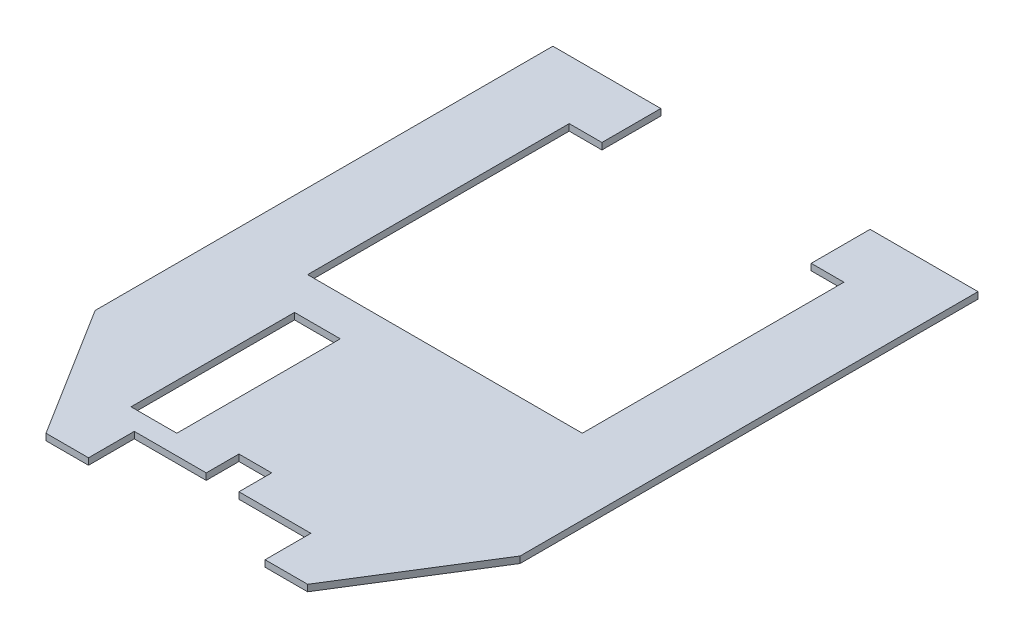
ISO-10303-21;
HEADER;
FILE_DESCRIPTION(('STEP AP214'),'2;1');
FILE_NAME('part.step','',(''),(''),'','','');
FILE_SCHEMA(('AUTOMOTIVE_DESIGN { 1 0 10303 214 1 1 1 1 }'));
ENDSEC;
DATA;
#1=APPLICATION_CONTEXT('core data for automotive mechanical design processes');
#2=APPLICATION_PROTOCOL_DEFINITION('international standard','automotive_design',2000,#1);
#3=PRODUCT_CONTEXT('',#1,'mechanical');
#4=PRODUCT('Part','Part','',(#3));
#5=PRODUCT_RELATED_PRODUCT_CATEGORY('part','',(#4));
#6=PRODUCT_DEFINITION_FORMATION('','',#4);
#7=PRODUCT_DEFINITION_CONTEXT('part definition',#1,'design');
#8=PRODUCT_DEFINITION('design','',#6,#7);
#9=PRODUCT_DEFINITION_SHAPE('','',#8);
#10=(LENGTH_UNIT() NAMED_UNIT(*) SI_UNIT(.MILLI.,.METRE.));
#11=(NAMED_UNIT(*) PLANE_ANGLE_UNIT() SI_UNIT($,.RADIAN.));
#12=(NAMED_UNIT(*) SI_UNIT($,.STERADIAN.) SOLID_ANGLE_UNIT());
#13=UNCERTAINTY_MEASURE_WITH_UNIT(LENGTH_MEASURE(1.E-05),#10,'distance_accuracy_value','');
#14=(GEOMETRIC_REPRESENTATION_CONTEXT(3) GLOBAL_UNCERTAINTY_ASSIGNED_CONTEXT((#13)) GLOBAL_UNIT_ASSIGNED_CONTEXT((#10,
#11,#12)) REPRESENTATION_CONTEXT('',''));
#15=CARTESIAN_POINT('',(0.,0.,0.));
#16=DIRECTION('',(0.,0.,1.));
#17=DIRECTION('',(1.,0.,0.));
#18=AXIS2_PLACEMENT_3D('',#15,#16,#17);
#19=CARTESIAN_POINT('',(0.,1.,52.));
#20=DIRECTION('',(0.,1.,0.));
#21=DIRECTION('',(0.,0.,1.));
#22=AXIS2_PLACEMENT_3D('',#19,#20,#21);
#23=PLANE('',#22);
#24=DIRECTION('',(0.52999894000318,0.,0.847998304005088));
#25=VECTOR('',#24,1.);
#26=CARTESIAN_POINT('',(-32.5,1.,0.));
#27=LINE('',#26,#25);
#28=CARTESIAN_POINT('',(-32.5,1.,0.));
#29=VERTEX_POINT('',#28);
#30=CARTESIAN_POINT('',(-20.,1.,20.));
#31=VERTEX_POINT('',#30);
#32=EDGE_CURVE('E240',#29,#31,#27,.T.);
#33=ORIENTED_EDGE('',*,*,#32,.T.);
#34=DIRECTION('',(1.,0.,0.));
#35=VECTOR('',#34,1.);
#36=CARTESIAN_POINT('',(-20.,1.,20.));
#37=LINE('',#36,#35);
#38=CARTESIAN_POINT('',(-13.5,1.,20.));
#39=VERTEX_POINT('',#38);
#40=EDGE_CURVE('E243',#31,#39,#37,.T.);
#41=ORIENTED_EDGE('',*,*,#40,.T.);
#42=DIRECTION('',(0.,0.,-1.));
#43=VECTOR('',#42,1.);
#44=CARTESIAN_POINT('',(-13.5,1.,20.));
#45=LINE('',#44,#43);
#46=CARTESIAN_POINT('',(-13.5,1.,13.));
#47=VERTEX_POINT('',#46);
#48=EDGE_CURVE('E246',#39,#47,#45,.T.);
#49=ORIENTED_EDGE('',*,*,#48,.T.);
#50=DIRECTION('',(1.,0.,0.));
#51=VECTOR('',#50,1.);
#52=CARTESIAN_POINT('',(-13.5,1.,13.));
#53=LINE('',#52,#51);
#54=CARTESIAN_POINT('',(-2.5,1.,13.));
#55=VERTEX_POINT('',#54);
#56=EDGE_CURVE('E248',#47,#55,#53,.T.);
#57=ORIENTED_EDGE('',*,*,#56,.T.);
#58=DIRECTION('',(0.,0.,-1.));
#59=VECTOR('',#58,1.);
#60=CARTESIAN_POINT('',(-2.5,1.,13.));
#61=LINE('',#60,#59);
#62=CARTESIAN_POINT('',(-2.5,1.,8.));
#63=VERTEX_POINT('',#62);
#64=EDGE_CURVE('E250',#55,#63,#61,.T.);
#65=ORIENTED_EDGE('',*,*,#64,.T.);
#66=DIRECTION('',(1.,0.,0.));
#67=VECTOR('',#66,1.);
#68=CARTESIAN_POINT('',(-2.5,1.,8.));
#69=LINE('',#68,#67);
#70=CARTESIAN_POINT('',(2.5,1.,8.));
#71=VERTEX_POINT('',#70);
#72=EDGE_CURVE('E252',#63,#71,#69,.T.);
#73=ORIENTED_EDGE('',*,*,#72,.T.);
#74=DIRECTION('',(0.,0.,1.));
#75=VECTOR('',#74,1.);
#76=CARTESIAN_POINT('',(2.5,1.,8.));
#77=LINE('',#76,#75);
#78=CARTESIAN_POINT('',(2.5,1.,13.));
#79=VERTEX_POINT('',#78);
#80=EDGE_CURVE('E254',#71,#79,#77,.T.);
#81=ORIENTED_EDGE('',*,*,#80,.T.);
#82=DIRECTION('',(1.,0.,0.));
#83=VECTOR('',#82,1.);
#84=CARTESIAN_POINT('',(2.5,1.,13.));
#85=LINE('',#84,#83);
#86=CARTESIAN_POINT('',(13.5,1.,13.));
#87=VERTEX_POINT('',#86);
#88=EDGE_CURVE('E256',#79,#87,#85,.T.);
#89=ORIENTED_EDGE('',*,*,#88,.T.);
#90=DIRECTION('',(0.,0.,1.));
#91=VECTOR('',#90,1.);
#92=CARTESIAN_POINT('',(13.5,1.,13.));
#93=LINE('',#92,#91);
#94=CARTESIAN_POINT('',(13.5,1.,20.));
#95=VERTEX_POINT('',#94);
#96=EDGE_CURVE('E258',#87,#95,#93,.T.);
#97=ORIENTED_EDGE('',*,*,#96,.T.);
#98=DIRECTION('',(1.,0.,0.));
#99=VECTOR('',#98,1.);
#100=CARTESIAN_POINT('',(13.5,1.,20.));
#101=LINE('',#100,#99);
#102=CARTESIAN_POINT('',(20.,1.,20.));
#103=VERTEX_POINT('',#102);
#104=EDGE_CURVE('E260',#95,#103,#101,.T.);
#105=ORIENTED_EDGE('',*,*,#104,.T.);
#106=DIRECTION('',(0.52999894000318,0.,-0.847998304005088));
#107=VECTOR('',#106,1.);
#108=CARTESIAN_POINT('',(20.,1.,20.));
#109=LINE('',#108,#107);
#110=CARTESIAN_POINT('',(32.5,1.,0.));
#111=VERTEX_POINT('',#110);
#112=EDGE_CURVE('E262',#103,#111,#109,.T.);
#113=ORIENTED_EDGE('',*,*,#112,.T.);
#114=DIRECTION('',(0.,0.,-1.));
#115=VECTOR('',#114,1.);
#116=CARTESIAN_POINT('',(32.5,1.,0.));
#117=LINE('',#116,#115);
#118=CARTESIAN_POINT('',(32.5,1.,-70.));
#119=VERTEX_POINT('',#118);
#120=EDGE_CURVE('E264',#111,#119,#117,.T.);
#121=ORIENTED_EDGE('',*,*,#120,.T.);
#122=DIRECTION('',(-1.,0.,0.));
#123=VECTOR('',#122,1.);
#124=CARTESIAN_POINT('',(32.5,1.,-70.));
#125=LINE('',#124,#123);
#126=CARTESIAN_POINT('',(16.,1.,-70.));
#127=VERTEX_POINT('',#126);
#128=EDGE_CURVE('E266',#119,#127,#125,.T.);
#129=ORIENTED_EDGE('',*,*,#128,.T.);
#130=DIRECTION('',(0.,0.,1.));
#131=VECTOR('',#130,1.);
#132=CARTESIAN_POINT('',(16.,1.,-61.));
#133=LINE('',#132,#131);
#134=CARTESIAN_POINT('',(16.,1.,-61.));
#135=VERTEX_POINT('',#134);
#136=EDGE_CURVE('E268',#127,#135,#133,.T.);
#137=ORIENTED_EDGE('',*,*,#136,.T.);
#138=DIRECTION('',(1.,0.,0.));
#139=VECTOR('',#138,1.);
#140=CARTESIAN_POINT('',(21.,1.,-61.));
#141=LINE('',#140,#139);
#142=CARTESIAN_POINT('',(21.,1.,-61.));
#143=VERTEX_POINT('',#142);
#144=EDGE_CURVE('E270',#135,#143,#141,.T.);
#145=ORIENTED_EDGE('',*,*,#144,.T.);
#146=DIRECTION('',(0.,0.,1.));
#147=VECTOR('',#146,1.);
#148=CARTESIAN_POINT('',(21.,1.,-61.));
#149=LINE('',#148,#147);
#150=CARTESIAN_POINT('',(21.,1.,-21.));
#151=VERTEX_POINT('',#150);
#152=EDGE_CURVE('E272',#143,#151,#149,.T.);
#153=ORIENTED_EDGE('',*,*,#152,.T.);
#154=DIRECTION('',(-1.,0.,0.));
#155=VECTOR('',#154,1.);
#156=CARTESIAN_POINT('',(21.,1.,-21.));
#157=LINE('',#156,#155);
#158=CARTESIAN_POINT('',(-21.,1.,-21.));
#159=VERTEX_POINT('',#158);
#160=EDGE_CURVE('E274',#151,#159,#157,.T.);
#161=ORIENTED_EDGE('',*,*,#160,.T.);
#162=DIRECTION('',(0.,0.,-1.));
#163=VECTOR('',#162,1.);
#164=CARTESIAN_POINT('',(-21.,1.,-61.));
#165=LINE('',#164,#163);
#166=CARTESIAN_POINT('',(-21.,1.,-61.));
#167=VERTEX_POINT('',#166);
#168=EDGE_CURVE('E276',#159,#167,#165,.T.);
#169=ORIENTED_EDGE('',*,*,#168,.T.);
#170=DIRECTION('',(1.,0.,0.));
#171=VECTOR('',#170,1.);
#172=CARTESIAN_POINT('',(-16.,1.,-61.));
#173=LINE('',#172,#171);
#174=CARTESIAN_POINT('',(-16.,1.,-61.));
#175=VERTEX_POINT('',#174);
#176=EDGE_CURVE('E278',#167,#175,#173,.T.);
#177=ORIENTED_EDGE('',*,*,#176,.T.);
#178=DIRECTION('',(0.,0.,-1.));
#179=VECTOR('',#178,1.);
#180=CARTESIAN_POINT('',(-16.,1.,-61.));
#181=LINE('',#180,#179);
#182=CARTESIAN_POINT('',(-16.,1.,-70.));
#183=VERTEX_POINT('',#182);
#184=EDGE_CURVE('E280',#175,#183,#181,.T.);
#185=ORIENTED_EDGE('',*,*,#184,.T.);
#186=DIRECTION('',(-1.,0.,0.));
#187=VECTOR('',#186,1.);
#188=CARTESIAN_POINT('',(-16.,1.,-70.));
#189=LINE('',#188,#187);
#190=CARTESIAN_POINT('',(-32.5,1.,-70.));
#191=VERTEX_POINT('',#190);
#192=EDGE_CURVE('E282',#183,#191,#189,.T.);
#193=ORIENTED_EDGE('',*,*,#192,.T.);
#194=DIRECTION('',(0.,0.,1.));
#195=VECTOR('',#194,1.);
#196=CARTESIAN_POINT('',(-32.5,1.,-70.));
#197=LINE('',#196,#195);
#198=EDGE_CURVE('E284',#191,#29,#197,.T.);
#199=ORIENTED_EDGE('',*,*,#198,.T.);
#200=EDGE_LOOP('',(#33,#41,#49,#57,#65,#73,#81,#89,#97,#105,#113,#121,#129,#137,#145,#153,#161,
#169,#177,#185,#193,#199));
#201=FACE_BOUND('',#200,.T.);
#202=DIRECTION('',(-1.,0.,0.));
#203=VECTOR('',#202,1.);
#204=CARTESIAN_POINT('',(-10.,1.,-15.));
#205=LINE('',#204,#203);
#206=CARTESIAN_POINT('',(-10.,1.,-15.));
#207=VERTEX_POINT('',#206);
#208=CARTESIAN_POINT('',(-17.,1.,-15.));
#209=VERTEX_POINT('',#208);
#210=EDGE_CURVE('E212',#207,#209,#205,.T.);
#211=ORIENTED_EDGE('',*,*,#210,.F.);
#212=DIRECTION('',(0.,0.,-1.));
#213=VECTOR('',#212,1.);
#214=CARTESIAN_POINT('',(-10.,1.,10.));
#215=LINE('',#214,#213);
#216=CARTESIAN_POINT('',(-10.,1.,10.));
#217=VERTEX_POINT('',#216);
#218=EDGE_CURVE('E204',#217,#207,#215,.T.);
#219=ORIENTED_EDGE('',*,*,#218,.F.);
#220=DIRECTION('',(1.,0.,0.));
#221=VECTOR('',#220,1.);
#222=CARTESIAN_POINT('',(-10.,1.,10.));
#223=LINE('',#222,#221);
#224=CARTESIAN_POINT('',(-17.,1.,10.));
#225=VERTEX_POINT('',#224);
#226=EDGE_CURVE('E226',#225,#217,#223,.T.);
#227=ORIENTED_EDGE('',*,*,#226,.F.);
#228=DIRECTION('',(0.,0.,1.));
#229=VECTOR('',#228,1.);
#230=CARTESIAN_POINT('',(-17.,1.,10.));
#231=LINE('',#230,#229);
#232=EDGE_CURVE('E224',#209,#225,#231,.T.);
#233=ORIENTED_EDGE('',*,*,#232,.F.);
#234=EDGE_LOOP('',(#211,#219,#227,#233));
#235=FACE_BOUND('',#234,.T.);
#236=ADVANCED_FACE('F31',(#201,#235),#23,.T.);
#237=CARTESIAN_POINT('',(0.,0.,52.));
#238=DIRECTION('',(0.,1.,0.));
#239=DIRECTION('',(0.,0.,1.));
#240=AXIS2_PLACEMENT_3D('',#237,#238,#239);
#241=PLANE('',#240);
#242=DIRECTION('',(0.52999894000318,0.,0.847998304005088));
#243=VECTOR('',#242,1.);
#244=CARTESIAN_POINT('',(-32.5,0.,0.));
#245=LINE('',#244,#243);
#246=CARTESIAN_POINT('',(-32.5,0.,0.));
#247=VERTEX_POINT('',#246);
#248=CARTESIAN_POINT('',(-20.,0.,20.));
#249=VERTEX_POINT('',#248);
#250=EDGE_CURVE('E220',#247,#249,#245,.T.);
#251=ORIENTED_EDGE('',*,*,#250,.F.);
#252=DIRECTION('',(0.,0.,1.));
#253=VECTOR('',#252,1.);
#254=CARTESIAN_POINT('',(-32.5,0.,-70.));
#255=LINE('',#254,#253);
#256=CARTESIAN_POINT('',(-32.5,0.,-70.));
#257=VERTEX_POINT('',#256);
#258=EDGE_CURVE('E244',#257,#247,#255,.T.);
#259=ORIENTED_EDGE('',*,*,#258,.F.);
#260=DIRECTION('',(-1.,0.,0.));
#261=VECTOR('',#260,1.);
#262=CARTESIAN_POINT('',(-16.,0.,-70.));
#263=LINE('',#262,#261);
#264=CARTESIAN_POINT('',(-16.,0.,-70.));
#265=VERTEX_POINT('',#264);
#266=EDGE_CURVE('E327',#265,#257,#263,.T.);
#267=ORIENTED_EDGE('',*,*,#266,.F.);
#268=DIRECTION('',(0.,0.,-1.));
#269=VECTOR('',#268,1.);
#270=CARTESIAN_POINT('',(-16.,0.,-61.));
#271=LINE('',#270,#269);
#272=CARTESIAN_POINT('',(-16.,0.,-61.));
#273=VERTEX_POINT('',#272);
#274=EDGE_CURVE('E325',#273,#265,#271,.T.);
#275=ORIENTED_EDGE('',*,*,#274,.F.);
#276=DIRECTION('',(1.,0.,0.));
#277=VECTOR('',#276,1.);
#278=CARTESIAN_POINT('',(-16.,0.,-61.));
#279=LINE('',#278,#277);
#280=CARTESIAN_POINT('',(-21.,0.,-61.));
#281=VERTEX_POINT('',#280);
#282=EDGE_CURVE('E323',#281,#273,#279,.T.);
#283=ORIENTED_EDGE('',*,*,#282,.F.);
#284=DIRECTION('',(0.,0.,-1.));
#285=VECTOR('',#284,1.);
#286=CARTESIAN_POINT('',(-21.,0.,-61.));
#287=LINE('',#286,#285);
#288=CARTESIAN_POINT('',(-21.,0.,-21.));
#289=VERTEX_POINT('',#288);
#290=EDGE_CURVE('E321',#289,#281,#287,.T.);
#291=ORIENTED_EDGE('',*,*,#290,.F.);
#292=DIRECTION('',(-1.,0.,0.));
#293=VECTOR('',#292,1.);
#294=CARTESIAN_POINT('',(21.,0.,-21.));
#295=LINE('',#294,#293);
#296=CARTESIAN_POINT('',(21.,0.,-21.));
#297=VERTEX_POINT('',#296);
#298=EDGE_CURVE('E319',#297,#289,#295,.T.);
#299=ORIENTED_EDGE('',*,*,#298,.F.);
#300=DIRECTION('',(0.,0.,1.));
#301=VECTOR('',#300,1.);
#302=CARTESIAN_POINT('',(21.,0.,-61.));
#303=LINE('',#302,#301);
#304=CARTESIAN_POINT('',(21.,0.,-61.));
#305=VERTEX_POINT('',#304);
#306=EDGE_CURVE('E317',#305,#297,#303,.T.);
#307=ORIENTED_EDGE('',*,*,#306,.F.);
#308=DIRECTION('',(1.,0.,0.));
#309=VECTOR('',#308,1.);
#310=CARTESIAN_POINT('',(21.,0.,-61.));
#311=LINE('',#310,#309);
#312=CARTESIAN_POINT('',(16.,0.,-61.));
#313=VERTEX_POINT('',#312);
#314=EDGE_CURVE('E315',#313,#305,#311,.T.);
#315=ORIENTED_EDGE('',*,*,#314,.F.);
#316=DIRECTION('',(0.,0.,1.));
#317=VECTOR('',#316,1.);
#318=CARTESIAN_POINT('',(16.,0.,-61.));
#319=LINE('',#318,#317);
#320=CARTESIAN_POINT('',(16.,0.,-70.));
#321=VERTEX_POINT('',#320);
#322=EDGE_CURVE('E313',#321,#313,#319,.T.);
#323=ORIENTED_EDGE('',*,*,#322,.F.);
#324=DIRECTION('',(-1.,0.,0.));
#325=VECTOR('',#324,1.);
#326=CARTESIAN_POINT('',(32.5,0.,-70.));
#327=LINE('',#326,#325);
#328=CARTESIAN_POINT('',(32.5,0.,-70.));
#329=VERTEX_POINT('',#328);
#330=EDGE_CURVE('E311',#329,#321,#327,.T.);
#331=ORIENTED_EDGE('',*,*,#330,.F.);
#332=DIRECTION('',(0.,0.,-1.));
#333=VECTOR('',#332,1.);
#334=CARTESIAN_POINT('',(32.5,0.,0.));
#335=LINE('',#334,#333);
#336=CARTESIAN_POINT('',(32.5,0.,0.));
#337=VERTEX_POINT('',#336);
#338=EDGE_CURVE('E309',#337,#329,#335,.T.);
#339=ORIENTED_EDGE('',*,*,#338,.F.);
#340=DIRECTION('',(0.52999894000318,0.,-0.847998304005088));
#341=VECTOR('',#340,1.);
#342=CARTESIAN_POINT('',(20.,0.,20.));
#343=LINE('',#342,#341);
#344=CARTESIAN_POINT('',(20.,0.,20.));
#345=VERTEX_POINT('',#344);
#346=EDGE_CURVE('E307',#345,#337,#343,.T.);
#347=ORIENTED_EDGE('',*,*,#346,.F.);
#348=DIRECTION('',(1.,0.,0.));
#349=VECTOR('',#348,1.);
#350=CARTESIAN_POINT('',(13.5,0.,20.));
#351=LINE('',#350,#349);
#352=CARTESIAN_POINT('',(13.5,0.,20.));
#353=VERTEX_POINT('',#352);
#354=EDGE_CURVE('E305',#353,#345,#351,.T.);
#355=ORIENTED_EDGE('',*,*,#354,.F.);
#356=DIRECTION('',(0.,0.,1.));
#357=VECTOR('',#356,1.);
#358=CARTESIAN_POINT('',(13.5,0.,13.));
#359=LINE('',#358,#357);
#360=CARTESIAN_POINT('',(13.5,0.,13.));
#361=VERTEX_POINT('',#360);
#362=EDGE_CURVE('E303',#361,#353,#359,.T.);
#363=ORIENTED_EDGE('',*,*,#362,.F.);
#364=DIRECTION('',(1.,0.,0.));
#365=VECTOR('',#364,1.);
#366=CARTESIAN_POINT('',(2.5,0.,13.));
#367=LINE('',#366,#365);
#368=CARTESIAN_POINT('',(2.5,0.,13.));
#369=VERTEX_POINT('',#368);
#370=EDGE_CURVE('E301',#369,#361,#367,.T.);
#371=ORIENTED_EDGE('',*,*,#370,.F.);
#372=DIRECTION('',(0.,0.,1.));
#373=VECTOR('',#372,1.);
#374=CARTESIAN_POINT('',(2.5,0.,8.));
#375=LINE('',#374,#373);
#376=CARTESIAN_POINT('',(2.5,0.,8.));
#377=VERTEX_POINT('',#376);
#378=EDGE_CURVE('E299',#377,#369,#375,.T.);
#379=ORIENTED_EDGE('',*,*,#378,.F.);
#380=DIRECTION('',(1.,0.,0.));
#381=VECTOR('',#380,1.);
#382=CARTESIAN_POINT('',(-2.5,0.,8.));
#383=LINE('',#382,#381);
#384=CARTESIAN_POINT('',(-2.5,0.,8.));
#385=VERTEX_POINT('',#384);
#386=EDGE_CURVE('E297',#385,#377,#383,.T.);
#387=ORIENTED_EDGE('',*,*,#386,.F.);
#388=DIRECTION('',(0.,0.,-1.));
#389=VECTOR('',#388,1.);
#390=CARTESIAN_POINT('',(-2.5,0.,13.));
#391=LINE('',#390,#389);
#392=CARTESIAN_POINT('',(-2.5,0.,13.));
#393=VERTEX_POINT('',#392);
#394=EDGE_CURVE('E295',#393,#385,#391,.T.);
#395=ORIENTED_EDGE('',*,*,#394,.F.);
#396=DIRECTION('',(1.,0.,0.));
#397=VECTOR('',#396,1.);
#398=CARTESIAN_POINT('',(-13.5,0.,13.));
#399=LINE('',#398,#397);
#400=CARTESIAN_POINT('',(-13.5,0.,13.));
#401=VERTEX_POINT('',#400);
#402=EDGE_CURVE('E293',#401,#393,#399,.T.);
#403=ORIENTED_EDGE('',*,*,#402,.F.);
#404=DIRECTION('',(0.,0.,-1.));
#405=VECTOR('',#404,1.);
#406=CARTESIAN_POINT('',(-13.5,0.,20.));
#407=LINE('',#406,#405);
#408=CARTESIAN_POINT('',(-13.5,0.,20.));
#409=VERTEX_POINT('',#408);
#410=EDGE_CURVE('E291',#409,#401,#407,.T.);
#411=ORIENTED_EDGE('',*,*,#410,.F.);
#412=DIRECTION('',(1.,0.,0.));
#413=VECTOR('',#412,1.);
#414=CARTESIAN_POINT('',(-20.,0.,20.));
#415=LINE('',#414,#413);
#416=EDGE_CURVE('E289',#249,#409,#415,.T.);
#417=ORIENTED_EDGE('',*,*,#416,.F.);
#418=EDGE_LOOP('',(#251,#259,#267,#275,#283,#291,#299,#307,#315,#323,#331,#339,#347,#355,#363,
#371,#379,#387,#395,#403,#411,#417));
#419=FACE_BOUND('',#418,.T.);
#420=DIRECTION('',(0.,0.,-1.));
#421=VECTOR('',#420,1.);
#422=CARTESIAN_POINT('',(-10.,0.,10.));
#423=LINE('',#422,#421);
#424=CARTESIAN_POINT('',(-10.,0.,10.));
#425=VERTEX_POINT('',#424);
#426=CARTESIAN_POINT('',(-10.,0.,-15.));
#427=VERTEX_POINT('',#426);
#428=EDGE_CURVE('E54',#425,#427,#423,.T.);
#429=ORIENTED_EDGE('',*,*,#428,.T.);
#430=DIRECTION('',(-1.,0.,0.));
#431=VECTOR('',#430,1.);
#432=CARTESIAN_POINT('',(-10.,0.,-15.));
#433=LINE('',#432,#431);
#434=CARTESIAN_POINT('',(-17.,0.,-15.));
#435=VERTEX_POINT('',#434);
#436=EDGE_CURVE('E219',#427,#435,#433,.T.);
#437=ORIENTED_EDGE('',*,*,#436,.T.);
#438=DIRECTION('',(0.,0.,1.));
#439=VECTOR('',#438,1.);
#440=CARTESIAN_POINT('',(-17.,0.,10.));
#441=LINE('',#440,#439);
#442=CARTESIAN_POINT('',(-17.,0.,10.));
#443=VERTEX_POINT('',#442);
#444=EDGE_CURVE('E232',#435,#443,#441,.T.);
#445=ORIENTED_EDGE('',*,*,#444,.T.);
#446=DIRECTION('',(1.,0.,0.));
#447=VECTOR('',#446,1.);
#448=CARTESIAN_POINT('',(-10.,0.,10.));
#449=LINE('',#448,#447);
#450=EDGE_CURVE('E213',#443,#425,#449,.T.);
#451=ORIENTED_EDGE('',*,*,#450,.T.);
#452=EDGE_LOOP('',(#429,#437,#445,#451));
#453=FACE_BOUND('',#452,.T.);
#454=ADVANCED_FACE('F399',(#419,#453),#241,.F.);
#455=CARTESIAN_POINT('',(-32.5,1.,0.));
#456=DIRECTION('',(0.847998304005088,0.,-0.52999894000318));
#457=DIRECTION('',(-0.52999894000318,0.,-0.847998304005088));
#458=AXIS2_PLACEMENT_3D('',#455,#456,#457);
#459=PLANE('',#458);
#460=ORIENTED_EDGE('',*,*,#250,.T.);
#461=DIRECTION('',(0.,-1.,0.));
#462=VECTOR('',#461,1.);
#463=CARTESIAN_POINT('',(-20.,1.,20.));
#464=LINE('',#463,#462);
#465=EDGE_CURVE('E11',#31,#249,#464,.T.);
#466=ORIENTED_EDGE('',*,*,#465,.F.);
#467=ORIENTED_EDGE('',*,*,#32,.F.);
#468=DIRECTION('',(0.,-1.,0.));
#469=VECTOR('',#468,1.);
#470=CARTESIAN_POINT('',(-32.5,1.,0.));
#471=LINE('',#470,#469);
#472=EDGE_CURVE('E286',#29,#247,#471,.T.);
#473=ORIENTED_EDGE('',*,*,#472,.T.);
#474=EDGE_LOOP('',(#460,#466,#467,#473));
#475=FACE_BOUND('',#474,.T.);
#476=ADVANCED_FACE('F33',(#475),#459,.F.);
#477=CARTESIAN_POINT('',(-20.,1.,20.));
#478=DIRECTION('',(0.,0.,-1.));
#479=DIRECTION('',(-1.,0.,0.));
#480=AXIS2_PLACEMENT_3D('',#477,#478,#479);
#481=PLANE('',#480);
#482=ORIENTED_EDGE('',*,*,#416,.T.);
#483=DIRECTION('',(0.,-1.,0.));
#484=VECTOR('',#483,1.);
#485=CARTESIAN_POINT('',(-13.5,1.,20.));
#486=LINE('',#485,#484);
#487=EDGE_CURVE('E39',#39,#409,#486,.T.);
#488=ORIENTED_EDGE('',*,*,#487,.F.);
#489=ORIENTED_EDGE('',*,*,#40,.F.);
#490=ORIENTED_EDGE('',*,*,#465,.T.);
#491=EDGE_LOOP('',(#482,#488,#489,#490));
#492=FACE_BOUND('',#491,.T.);
#493=ADVANCED_FACE('F416',(#492),#481,.F.);
#494=CARTESIAN_POINT('',(-13.5,1.,20.));
#495=DIRECTION('',(-1.,0.,0.));
#496=DIRECTION('',(0.,0.,1.));
#497=AXIS2_PLACEMENT_3D('',#494,#495,#496);
#498=PLANE('',#497);
#499=ORIENTED_EDGE('',*,*,#410,.T.);
#500=DIRECTION('',(0.,-1.,0.));
#501=VECTOR('',#500,1.);
#502=CARTESIAN_POINT('',(-13.5,1.,13.));
#503=LINE('',#502,#501);
#504=EDGE_CURVE('E386',#47,#401,#503,.T.);
#505=ORIENTED_EDGE('',*,*,#504,.F.);
#506=ORIENTED_EDGE('',*,*,#48,.F.);
#507=ORIENTED_EDGE('',*,*,#487,.T.);
#508=EDGE_LOOP('',(#499,#505,#506,#507));
#509=FACE_BOUND('',#508,.T.);
#510=ADVANCED_FACE('F393',(#509),#498,.F.);
#511=CARTESIAN_POINT('',(-13.5,1.,13.));
#512=DIRECTION('',(0.,0.,-1.));
#513=DIRECTION('',(-1.,0.,0.));
#514=AXIS2_PLACEMENT_3D('',#511,#512,#513);
#515=PLANE('',#514);
#516=ORIENTED_EDGE('',*,*,#402,.T.);
#517=DIRECTION('',(0.,-1.,0.));
#518=VECTOR('',#517,1.);
#519=CARTESIAN_POINT('',(-2.5,1.,13.));
#520=LINE('',#519,#518);
#521=EDGE_CURVE('E383',#55,#393,#520,.T.);
#522=ORIENTED_EDGE('',*,*,#521,.F.);
#523=ORIENTED_EDGE('',*,*,#56,.F.);
#524=ORIENTED_EDGE('',*,*,#504,.T.);
#525=EDGE_LOOP('',(#516,#522,#523,#524));
#526=FACE_BOUND('',#525,.T.);
#527=ADVANCED_FACE('F405',(#526),#515,.F.);
#528=CARTESIAN_POINT('',(-2.5,1.,13.));
#529=DIRECTION('',(-1.,0.,0.));
#530=DIRECTION('',(0.,0.,1.));
#531=AXIS2_PLACEMENT_3D('',#528,#529,#530);
#532=PLANE('',#531);
#533=ORIENTED_EDGE('',*,*,#394,.T.);
#534=DIRECTION('',(0.,-1.,0.));
#535=VECTOR('',#534,1.);
#536=CARTESIAN_POINT('',(-2.5,1.,8.));
#537=LINE('',#536,#535);
#538=EDGE_CURVE('E380',#63,#385,#537,.T.);
#539=ORIENTED_EDGE('',*,*,#538,.F.);
#540=ORIENTED_EDGE('',*,*,#64,.F.);
#541=ORIENTED_EDGE('',*,*,#521,.T.);
#542=EDGE_LOOP('',(#533,#539,#540,#541));
#543=FACE_BOUND('',#542,.T.);
#544=ADVANCED_FACE('F409',(#543),#532,.F.);
#545=CARTESIAN_POINT('',(-2.5,1.,8.));
#546=DIRECTION('',(0.,0.,-1.));
#547=DIRECTION('',(-1.,0.,0.));
#548=AXIS2_PLACEMENT_3D('',#545,#546,#547);
#549=PLANE('',#548);
#550=ORIENTED_EDGE('',*,*,#386,.T.);
#551=DIRECTION('',(0.,-1.,0.));
#552=VECTOR('',#551,1.);
#553=CARTESIAN_POINT('',(2.5,1.,8.));
#554=LINE('',#553,#552);
#555=EDGE_CURVE('E377',#71,#377,#554,.T.);
#556=ORIENTED_EDGE('',*,*,#555,.F.);
#557=ORIENTED_EDGE('',*,*,#72,.F.);
#558=ORIENTED_EDGE('',*,*,#538,.T.);
#559=EDGE_LOOP('',(#550,#556,#557,#558));
#560=FACE_BOUND('',#559,.T.);
#561=ADVANCED_FACE('F499',(#560),#549,.F.);
#562=CARTESIAN_POINT('',(2.5,1.,8.));
#563=DIRECTION('',(1.,0.,0.));
#564=DIRECTION('',(0.,0.,-1.));
#565=AXIS2_PLACEMENT_3D('',#562,#563,#564);
#566=PLANE('',#565);
#567=ORIENTED_EDGE('',*,*,#378,.T.);
#568=DIRECTION('',(0.,-1.,0.));
#569=VECTOR('',#568,1.);
#570=CARTESIAN_POINT('',(2.5,1.,13.));
#571=LINE('',#570,#569);
#572=EDGE_CURVE('E374',#79,#369,#571,.T.);
#573=ORIENTED_EDGE('',*,*,#572,.F.);
#574=ORIENTED_EDGE('',*,*,#80,.F.);
#575=ORIENTED_EDGE('',*,*,#555,.T.);
#576=EDGE_LOOP('',(#567,#573,#574,#575));
#577=FACE_BOUND('',#576,.T.);
#578=ADVANCED_FACE('F496',(#577),#566,.F.);
#579=CARTESIAN_POINT('',(2.5,1.,13.));
#580=DIRECTION('',(0.,0.,-1.));
#581=DIRECTION('',(-1.,0.,0.));
#582=AXIS2_PLACEMENT_3D('',#579,#580,#581);
#583=PLANE('',#582);
#584=ORIENTED_EDGE('',*,*,#370,.T.);
#585=DIRECTION('',(0.,-1.,0.));
#586=VECTOR('',#585,1.);
#587=CARTESIAN_POINT('',(13.5,1.,13.));
#588=LINE('',#587,#586);
#589=EDGE_CURVE('E371',#87,#361,#588,.T.);
#590=ORIENTED_EDGE('',*,*,#589,.F.);
#591=ORIENTED_EDGE('',*,*,#88,.F.);
#592=ORIENTED_EDGE('',*,*,#572,.T.);
#593=EDGE_LOOP('',(#584,#590,#591,#592));
#594=FACE_BOUND('',#593,.T.);
#595=ADVANCED_FACE('F492',(#594),#583,.F.);
#596=CARTESIAN_POINT('',(13.5,1.,13.));
#597=DIRECTION('',(1.,0.,0.));
#598=DIRECTION('',(0.,0.,-1.));
#599=AXIS2_PLACEMENT_3D('',#596,#597,#598);
#600=PLANE('',#599);
#601=ORIENTED_EDGE('',*,*,#362,.T.);
#602=DIRECTION('',(0.,-1.,0.));
#603=VECTOR('',#602,1.);
#604=CARTESIAN_POINT('',(13.5,1.,20.));
#605=LINE('',#604,#603);
#606=EDGE_CURVE('E368',#95,#353,#605,.T.);
#607=ORIENTED_EDGE('',*,*,#606,.F.);
#608=ORIENTED_EDGE('',*,*,#96,.F.);
#609=ORIENTED_EDGE('',*,*,#589,.T.);
#610=EDGE_LOOP('',(#601,#607,#608,#609));
#611=FACE_BOUND('',#610,.T.);
#612=ADVANCED_FACE('F488',(#611),#600,.F.);
#613=CARTESIAN_POINT('',(13.5,1.,20.));
#614=DIRECTION('',(0.,0.,-1.));
#615=DIRECTION('',(-1.,0.,0.));
#616=AXIS2_PLACEMENT_3D('',#613,#614,#615);
#617=PLANE('',#616);
#618=ORIENTED_EDGE('',*,*,#354,.T.);
#619=DIRECTION('',(0.,-1.,0.));
#620=VECTOR('',#619,1.);
#621=CARTESIAN_POINT('',(20.,1.,20.));
#622=LINE('',#621,#620);
#623=EDGE_CURVE('E365',#103,#345,#622,.T.);
#624=ORIENTED_EDGE('',*,*,#623,.F.);
#625=ORIENTED_EDGE('',*,*,#104,.F.);
#626=ORIENTED_EDGE('',*,*,#606,.T.);
#627=EDGE_LOOP('',(#618,#624,#625,#626));
#628=FACE_BOUND('',#627,.T.);
#629=ADVANCED_FACE('F483',(#628),#617,.F.);
#630=CARTESIAN_POINT('',(20.,1.,20.));
#631=DIRECTION('',(-0.847998304005088,0.,-0.52999894000318));
#632=DIRECTION('',(-0.52999894000318,0.,0.847998304005088));
#633=AXIS2_PLACEMENT_3D('',#630,#631,#632);
#634=PLANE('',#633);
#635=ORIENTED_EDGE('',*,*,#346,.T.);
#636=DIRECTION('',(0.,-1.,0.));
#637=VECTOR('',#636,1.);
#638=CARTESIAN_POINT('',(32.5,1.,0.));
#639=LINE('',#638,#637);
#640=EDGE_CURVE('E362',#111,#337,#639,.T.);
#641=ORIENTED_EDGE('',*,*,#640,.F.);
#642=ORIENTED_EDGE('',*,*,#112,.F.);
#643=ORIENTED_EDGE('',*,*,#623,.T.);
#644=EDGE_LOOP('',(#635,#641,#642,#643));
#645=FACE_BOUND('',#644,.T.);
#646=ADVANCED_FACE('F477',(#645),#634,.F.);
#647=CARTESIAN_POINT('',(32.5,1.,0.));
#648=DIRECTION('',(-1.,0.,0.));
#649=DIRECTION('',(0.,0.,1.));
#650=AXIS2_PLACEMENT_3D('',#647,#648,#649);
#651=PLANE('',#650);
#652=ORIENTED_EDGE('',*,*,#338,.T.);
#653=DIRECTION('',(0.,-1.,0.));
#654=VECTOR('',#653,1.);
#655=CARTESIAN_POINT('',(32.5,1.,-70.));
#656=LINE('',#655,#654);
#657=EDGE_CURVE('E359',#119,#329,#656,.T.);
#658=ORIENTED_EDGE('',*,*,#657,.F.);
#659=ORIENTED_EDGE('',*,*,#120,.F.);
#660=ORIENTED_EDGE('',*,*,#640,.T.);
#661=EDGE_LOOP('',(#652,#658,#659,#660));
#662=FACE_BOUND('',#661,.T.);
#663=ADVANCED_FACE('F473',(#662),#651,.F.);
#664=CARTESIAN_POINT('',(32.5,1.,-70.));
#665=DIRECTION('',(0.,0.,1.));
#666=DIRECTION('',(1.,0.,0.));
#667=AXIS2_PLACEMENT_3D('',#664,#665,#666);
#668=PLANE('',#667);
#669=ORIENTED_EDGE('',*,*,#330,.T.);
#670=DIRECTION('',(0.,-1.,0.));
#671=VECTOR('',#670,1.);
#672=CARTESIAN_POINT('',(16.,1.,-70.));
#673=LINE('',#672,#671);
#674=EDGE_CURVE('E356',#127,#321,#673,.T.);
#675=ORIENTED_EDGE('',*,*,#674,.F.);
#676=ORIENTED_EDGE('',*,*,#128,.F.);
#677=ORIENTED_EDGE('',*,*,#657,.T.);
#678=EDGE_LOOP('',(#669,#675,#676,#677));
#679=FACE_BOUND('',#678,.T.);
#680=ADVANCED_FACE('F468',(#679),#668,.F.);
#681=CARTESIAN_POINT('',(16.,1.,-61.));
#682=DIRECTION('',(1.,0.,0.));
#683=DIRECTION('',(0.,0.,-1.));
#684=AXIS2_PLACEMENT_3D('',#681,#682,#683);
#685=PLANE('',#684);
#686=ORIENTED_EDGE('',*,*,#322,.T.);
#687=DIRECTION('',(0.,-1.,0.));
#688=VECTOR('',#687,1.);
#689=CARTESIAN_POINT('',(16.,1.,-61.));
#690=LINE('',#689,#688);
#691=EDGE_CURVE('E353',#135,#313,#690,.T.);
#692=ORIENTED_EDGE('',*,*,#691,.F.);
#693=ORIENTED_EDGE('',*,*,#136,.F.);
#694=ORIENTED_EDGE('',*,*,#674,.T.);
#695=EDGE_LOOP('',(#686,#692,#693,#694));
#696=FACE_BOUND('',#695,.T.);
#697=ADVANCED_FACE('F462',(#696),#685,.F.);
#698=CARTESIAN_POINT('',(21.,1.,-61.));
#699=DIRECTION('',(0.,0.,-1.));
#700=DIRECTION('',(-1.,0.,0.));
#701=AXIS2_PLACEMENT_3D('',#698,#699,#700);
#702=PLANE('',#701);
#703=ORIENTED_EDGE('',*,*,#314,.T.);
#704=DIRECTION('',(0.,-1.,0.));
#705=VECTOR('',#704,1.);
#706=CARTESIAN_POINT('',(21.,1.,-61.));
#707=LINE('',#706,#705);
#708=EDGE_CURVE('E350',#143,#305,#707,.T.);
#709=ORIENTED_EDGE('',*,*,#708,.F.);
#710=ORIENTED_EDGE('',*,*,#144,.F.);
#711=ORIENTED_EDGE('',*,*,#691,.T.);
#712=EDGE_LOOP('',(#703,#709,#710,#711));
#713=FACE_BOUND('',#712,.T.);
#714=ADVANCED_FACE('F458',(#713),#702,.F.);
#715=CARTESIAN_POINT('',(21.,1.,-61.));
#716=DIRECTION('',(1.,0.,0.));
#717=DIRECTION('',(0.,0.,-1.));
#718=AXIS2_PLACEMENT_3D('',#715,#716,#717);
#719=PLANE('',#718);
#720=ORIENTED_EDGE('',*,*,#306,.T.);
#721=DIRECTION('',(0.,-1.,0.));
#722=VECTOR('',#721,1.);
#723=CARTESIAN_POINT('',(21.,1.,-21.));
#724=LINE('',#723,#722);
#725=EDGE_CURVE('E347',#151,#297,#724,.T.);
#726=ORIENTED_EDGE('',*,*,#725,.F.);
#727=ORIENTED_EDGE('',*,*,#152,.F.);
#728=ORIENTED_EDGE('',*,*,#708,.T.);
#729=EDGE_LOOP('',(#720,#726,#727,#728));
#730=FACE_BOUND('',#729,.T.);
#731=ADVANCED_FACE('F453',(#730),#719,.F.);
#732=CARTESIAN_POINT('',(21.,1.,-21.));
#733=DIRECTION('',(0.,0.,1.));
#734=DIRECTION('',(1.,0.,0.));
#735=AXIS2_PLACEMENT_3D('',#732,#733,#734);
#736=PLANE('',#735);
#737=ORIENTED_EDGE('',*,*,#298,.T.);
#738=DIRECTION('',(0.,-1.,0.));
#739=VECTOR('',#738,1.);
#740=CARTESIAN_POINT('',(-21.,1.,-21.));
#741=LINE('',#740,#739);
#742=EDGE_CURVE('E344',#159,#289,#741,.T.);
#743=ORIENTED_EDGE('',*,*,#742,.F.);
#744=ORIENTED_EDGE('',*,*,#160,.F.);
#745=ORIENTED_EDGE('',*,*,#725,.T.);
#746=EDGE_LOOP('',(#737,#743,#744,#745));
#747=FACE_BOUND('',#746,.T.);
#748=ADVANCED_FACE('F447',(#747),#736,.F.);
#749=CARTESIAN_POINT('',(-21.,1.,-61.));
#750=DIRECTION('',(-1.,0.,0.));
#751=DIRECTION('',(0.,0.,1.));
#752=AXIS2_PLACEMENT_3D('',#749,#750,#751);
#753=PLANE('',#752);
#754=ORIENTED_EDGE('',*,*,#290,.T.);
#755=DIRECTION('',(0.,-1.,0.));
#756=VECTOR('',#755,1.);
#757=CARTESIAN_POINT('',(-21.,1.,-61.));
#758=LINE('',#757,#756);
#759=EDGE_CURVE('E341',#167,#281,#758,.T.);
#760=ORIENTED_EDGE('',*,*,#759,.F.);
#761=ORIENTED_EDGE('',*,*,#168,.F.);
#762=ORIENTED_EDGE('',*,*,#742,.T.);
#763=EDGE_LOOP('',(#754,#760,#761,#762));
#764=FACE_BOUND('',#763,.T.);
#765=ADVANCED_FACE('F443',(#764),#753,.F.);
#766=CARTESIAN_POINT('',(-16.,1.,-61.));
#767=DIRECTION('',(0.,0.,-1.));
#768=DIRECTION('',(-1.,0.,0.));
#769=AXIS2_PLACEMENT_3D('',#766,#767,#768);
#770=PLANE('',#769);
#771=ORIENTED_EDGE('',*,*,#282,.T.);
#772=DIRECTION('',(0.,-1.,0.));
#773=VECTOR('',#772,1.);
#774=CARTESIAN_POINT('',(-16.,1.,-61.));
#775=LINE('',#774,#773);
#776=EDGE_CURVE('E338',#175,#273,#775,.T.);
#777=ORIENTED_EDGE('',*,*,#776,.F.);
#778=ORIENTED_EDGE('',*,*,#176,.F.);
#779=ORIENTED_EDGE('',*,*,#759,.T.);
#780=EDGE_LOOP('',(#771,#777,#778,#779));
#781=FACE_BOUND('',#780,.T.);
#782=ADVANCED_FACE('F438',(#781),#770,.F.);
#783=CARTESIAN_POINT('',(-16.,1.,-61.));
#784=DIRECTION('',(-1.,0.,0.));
#785=DIRECTION('',(0.,0.,1.));
#786=AXIS2_PLACEMENT_3D('',#783,#784,#785);
#787=PLANE('',#786);
#788=ORIENTED_EDGE('',*,*,#274,.T.);
#789=DIRECTION('',(0.,-1.,0.));
#790=VECTOR('',#789,1.);
#791=CARTESIAN_POINT('',(-16.,1.,-70.));
#792=LINE('',#791,#790);
#793=EDGE_CURVE('E335',#183,#265,#792,.T.);
#794=ORIENTED_EDGE('',*,*,#793,.F.);
#795=ORIENTED_EDGE('',*,*,#184,.F.);
#796=ORIENTED_EDGE('',*,*,#776,.T.);
#797=EDGE_LOOP('',(#788,#794,#795,#796));
#798=FACE_BOUND('',#797,.T.);
#799=ADVANCED_FACE('F432',(#798),#787,.F.);
#800=CARTESIAN_POINT('',(-16.,1.,-70.));
#801=DIRECTION('',(0.,0.,1.));
#802=DIRECTION('',(1.,0.,0.));
#803=AXIS2_PLACEMENT_3D('',#800,#801,#802);
#804=PLANE('',#803);
#805=ORIENTED_EDGE('',*,*,#266,.T.);
#806=DIRECTION('',(0.,-1.,0.));
#807=VECTOR('',#806,1.);
#808=CARTESIAN_POINT('',(-32.5,1.,-70.));
#809=LINE('',#808,#807);
#810=EDGE_CURVE('E332',#191,#257,#809,.T.);
#811=ORIENTED_EDGE('',*,*,#810,.F.);
#812=ORIENTED_EDGE('',*,*,#192,.F.);
#813=ORIENTED_EDGE('',*,*,#793,.T.);
#814=EDGE_LOOP('',(#805,#811,#812,#813));
#815=FACE_BOUND('',#814,.T.);
#816=ADVANCED_FACE('F428',(#815),#804,.F.);
#817=CARTESIAN_POINT('',(-32.5,1.,-70.));
#818=DIRECTION('',(1.,0.,0.));
#819=DIRECTION('',(0.,0.,-1.));
#820=AXIS2_PLACEMENT_3D('',#817,#818,#819);
#821=PLANE('',#820);
#822=ORIENTED_EDGE('',*,*,#258,.T.);
#823=ORIENTED_EDGE('',*,*,#472,.F.);
#824=ORIENTED_EDGE('',*,*,#198,.F.);
#825=ORIENTED_EDGE('',*,*,#810,.T.);
#826=EDGE_LOOP('',(#822,#823,#824,#825));
#827=FACE_BOUND('',#826,.T.);
#828=ADVANCED_FACE('F423',(#827),#821,.F.);
#829=CARTESIAN_POINT('',(-10.,1.,10.));
#830=DIRECTION('',(-1.,0.,0.));
#831=DIRECTION('',(0.,0.,1.));
#832=AXIS2_PLACEMENT_3D('',#829,#830,#831);
#833=PLANE('',#832);
#834=ORIENTED_EDGE('',*,*,#428,.F.);
#835=DIRECTION('',(0.,-1.,0.));
#836=VECTOR('',#835,1.);
#837=CARTESIAN_POINT('',(-10.,1.,10.));
#838=LINE('',#837,#836);
#839=EDGE_CURVE('E208',#217,#425,#838,.T.);
#840=ORIENTED_EDGE('',*,*,#839,.F.);
#841=ORIENTED_EDGE('',*,*,#218,.T.);
#842=DIRECTION('',(0.,-1.,0.));
#843=VECTOR('',#842,1.);
#844=CARTESIAN_POINT('',(-10.,1.,-15.));
#845=LINE('',#844,#843);
#846=EDGE_CURVE('E207',#207,#427,#845,.T.);
#847=ORIENTED_EDGE('',*,*,#846,.T.);
#848=EDGE_LOOP('',(#834,#840,#841,#847));
#849=FACE_BOUND('',#848,.T.);
#850=ADVANCED_FACE('F206',(#849),#833,.T.);
#851=CARTESIAN_POINT('',(-10.,1.,-15.));
#852=DIRECTION('',(0.,0.,1.));
#853=DIRECTION('',(1.,0.,0.));
#854=AXIS2_PLACEMENT_3D('',#851,#852,#853);
#855=PLANE('',#854);
#856=ORIENTED_EDGE('',*,*,#436,.F.);
#857=ORIENTED_EDGE('',*,*,#846,.F.);
#858=ORIENTED_EDGE('',*,*,#210,.T.);
#859=DIRECTION('',(0.,-1.,0.));
#860=VECTOR('',#859,1.);
#861=CARTESIAN_POINT('',(-17.,1.,-15.));
#862=LINE('',#861,#860);
#863=EDGE_CURVE('E221',#209,#435,#862,.T.);
#864=ORIENTED_EDGE('',*,*,#863,.T.);
#865=EDGE_LOOP('',(#856,#857,#858,#864));
#866=FACE_BOUND('',#865,.T.);
#867=ADVANCED_FACE('F216',(#866),#855,.T.);
#868=CARTESIAN_POINT('',(-17.,1.,10.));
#869=DIRECTION('',(1.,0.,0.));
#870=DIRECTION('',(0.,0.,-1.));
#871=AXIS2_PLACEMENT_3D('',#868,#869,#870);
#872=PLANE('',#871);
#873=ORIENTED_EDGE('',*,*,#444,.F.);
#874=ORIENTED_EDGE('',*,*,#863,.F.);
#875=ORIENTED_EDGE('',*,*,#232,.T.);
#876=DIRECTION('',(0.,-1.,0.));
#877=VECTOR('',#876,1.);
#878=CARTESIAN_POINT('',(-17.,1.,10.));
#879=LINE('',#878,#877);
#880=EDGE_CURVE('E46',#225,#443,#879,.T.);
#881=ORIENTED_EDGE('',*,*,#880,.T.);
#882=EDGE_LOOP('',(#873,#874,#875,#881));
#883=FACE_BOUND('',#882,.T.);
#884=ADVANCED_FACE('F617',(#883),#872,.T.);
#885=CARTESIAN_POINT('',(-10.,1.,10.));
#886=DIRECTION('',(0.,0.,-1.));
#887=DIRECTION('',(-1.,0.,0.));
#888=AXIS2_PLACEMENT_3D('',#885,#886,#887);
#889=PLANE('',#888);
#890=ORIENTED_EDGE('',*,*,#450,.F.);
#891=ORIENTED_EDGE('',*,*,#880,.F.);
#892=ORIENTED_EDGE('',*,*,#226,.T.);
#893=ORIENTED_EDGE('',*,*,#839,.T.);
#894=EDGE_LOOP('',(#890,#891,#892,#893));
#895=FACE_BOUND('',#894,.T.);
#896=ADVANCED_FACE('F623',(#895),#889,.T.);
#897=CLOSED_SHELL('',(#236,#454,#476,#493,#510,#527,#544,#561,#578,#595,#612,#629,#646,#663,
#680,#697,#714,#731,#748,#765,#782,#799,#816,#828,#850,#867,#884,#896));
#898=MANIFOLD_SOLID_BREP('B2',#897);
#899=ADVANCED_BREP_SHAPE_REPRESENTATION('',(#18,#898),#14);
#900=SHAPE_DEFINITION_REPRESENTATION(#9,#899);
ENDSEC;
END-ISO-10303-21;
